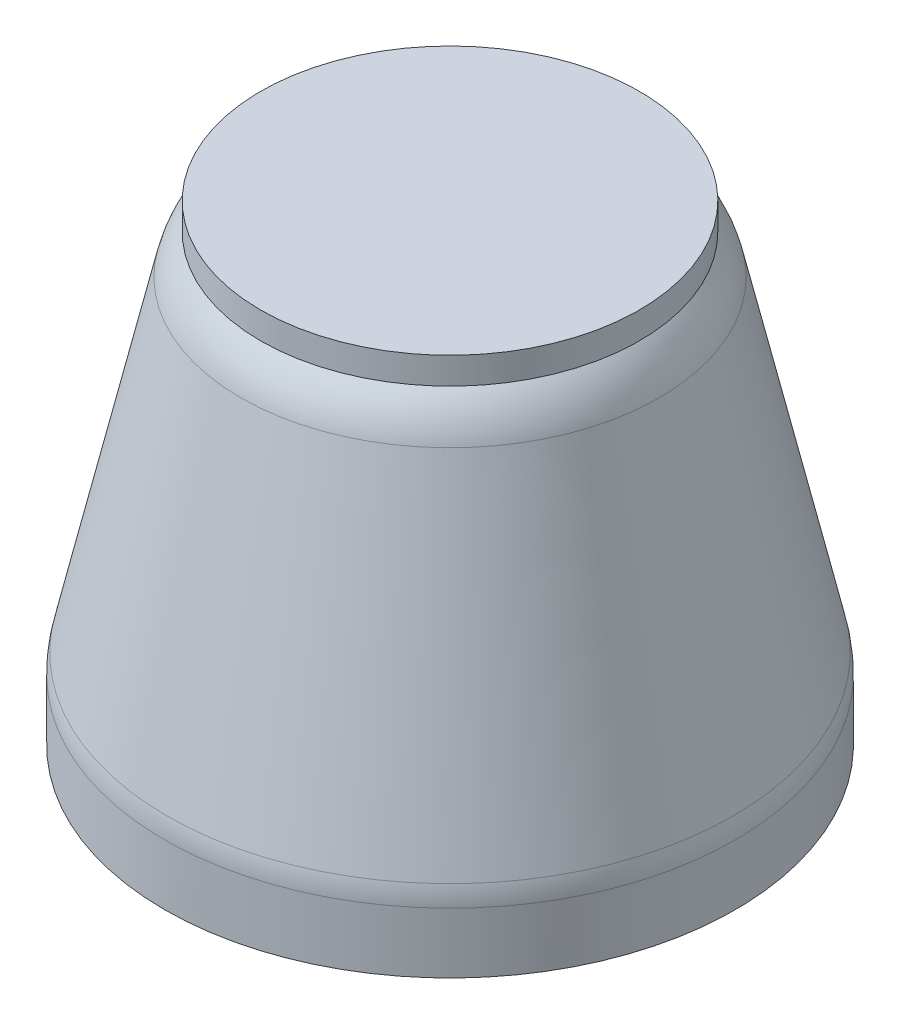
ISO-10303-21;
HEADER;
FILE_DESCRIPTION(('STEP AP214'),'2;1');
FILE_NAME('part.step','',(''),(''),'','','');
FILE_SCHEMA(('AUTOMOTIVE_DESIGN { 1 0 10303 214 1 1 1 1 }'));
ENDSEC;
DATA;
#1=APPLICATION_CONTEXT('core data for automotive mechanical design processes');
#2=APPLICATION_PROTOCOL_DEFINITION('international standard','automotive_design',2000,#1);
#3=PRODUCT_CONTEXT('',#1,'mechanical');
#4=PRODUCT('Part','Part','',(#3));
#5=PRODUCT_RELATED_PRODUCT_CATEGORY('part','',(#4));
#6=PRODUCT_DEFINITION_FORMATION('','',#4);
#7=PRODUCT_DEFINITION_CONTEXT('part definition',#1,'design');
#8=PRODUCT_DEFINITION('design','',#6,#7);
#9=PRODUCT_DEFINITION_SHAPE('','',#8);
#10=(LENGTH_UNIT() NAMED_UNIT(*) SI_UNIT(.MILLI.,.METRE.));
#11=(NAMED_UNIT(*) PLANE_ANGLE_UNIT() SI_UNIT($,.RADIAN.));
#12=(NAMED_UNIT(*) SI_UNIT($,.STERADIAN.) SOLID_ANGLE_UNIT());
#13=UNCERTAINTY_MEASURE_WITH_UNIT(LENGTH_MEASURE(1.E-05),#10,'distance_accuracy_value','');
#14=(GEOMETRIC_REPRESENTATION_CONTEXT(3) GLOBAL_UNCERTAINTY_ASSIGNED_CONTEXT((#13)) GLOBAL_UNIT_ASSIGNED_CONTEXT((#10,
#11,#12)) REPRESENTATION_CONTEXT('',''));
#15=CARTESIAN_POINT('',(0.,0.,0.));
#16=DIRECTION('',(0.,0.,1.));
#17=DIRECTION('',(1.,0.,0.));
#18=AXIS2_PLACEMENT_3D('',#15,#16,#17);
#19=CARTESIAN_POINT('',(0.,15.8,0.));
#20=DIRECTION('',(0.,-1.,0.));
#21=DIRECTION('',(0.,0.,-1.));
#22=AXIS2_PLACEMENT_3D('',#19,#20,#21);
#23=CYLINDRICAL_SURFACE('',#22,64.);
#24=CARTESIAN_POINT('',(0.,13.5663089692838,0.));
#25=DIRECTION('',(0.,-1.,0.));
#26=DIRECTION('',(0.,0.,-1.));
#27=AXIS2_PLACEMENT_3D('',#24,#25,#26);
#28=CIRCLE('',#27,64.);
#29=CARTESIAN_POINT('',(0.,13.5663089692838,-64.));
#30=VERTEX_POINT('',#29);
#31=EDGE_CURVE('E13',#30,#30,#28,.T.);
#32=ORIENTED_EDGE('',*,*,#31,.T.);
#33=EDGE_LOOP('',(#32));
#34=FACE_BOUND('',#33,.T.);
#35=CARTESIAN_POINT('',(0.,0.,0.));
#36=DIRECTION('',(0.,1.,0.));
#37=DIRECTION('',(0.,0.,1.));
#38=AXIS2_PLACEMENT_3D('',#35,#36,#37);
#39=CIRCLE('',#38,64.);
#40=CARTESIAN_POINT('',(0.,0.,64.));
#41=VERTEX_POINT('',#40);
#42=EDGE_CURVE('E61',#41,#41,#39,.T.);
#43=ORIENTED_EDGE('',*,*,#42,.T.);
#44=EDGE_LOOP('',(#43));
#45=FACE_BOUND('',#44,.T.);
#46=ADVANCED_FACE('F46',(#34,#45),#23,.T.);
#47=CARTESIAN_POINT('',(0.,0.,0.));
#48=DIRECTION('',(0.,1.,0.));
#49=DIRECTION('',(0.,0.,1.));
#50=AXIS2_PLACEMENT_3D('',#47,#48,#49);
#51=PLANE('',#50);
#52=CARTESIAN_POINT('',(0.,0.,0.));
#53=DIRECTION('',(0.,-1.,0.));
#54=DIRECTION('',(0.,0.,-1.));
#55=AXIS2_PLACEMENT_3D('',#52,#53,#54);
#56=CIRCLE('',#55,50.);
#57=CARTESIAN_POINT('',(0.,0.,-50.));
#58=VERTEX_POINT('',#57);
#59=EDGE_CURVE('E75',#58,#58,#56,.T.);
#60=ORIENTED_EDGE('',*,*,#59,.F.);
#61=EDGE_LOOP('',(#60));
#62=FACE_BOUND('',#61,.T.);
#63=ORIENTED_EDGE('',*,*,#42,.F.);
#64=EDGE_LOOP('',(#63));
#65=FACE_BOUND('',#64,.T.);
#66=ADVANCED_FACE('F81',(#62,#65),#51,.F.);
#67=CARTESIAN_POINT('',(0.,99.8,0.));
#68=DIRECTION('',(0.,-1.,0.));
#69=DIRECTION('',(0.,0.,-1.));
#70=AXIS2_PLACEMENT_3D('',#67,#68,#69);
#71=CONICAL_SURFACE('',#70,45.,0.222447265425942);
#72=CARTESIAN_POINT('',(0.,91.0034813089583,0.));
#73=DIRECTION('',(0.,-1.,0.));
#74=DIRECTION('',(0.,0.,-1.));
#75=AXIS2_PLACEMENT_3D('',#72,#73,#74);
#76=CIRCLE('',#75,46.9896887515452);
#77=CARTESIAN_POINT('',(0.,91.0034813089583,-46.9896887515452));
#78=VERTEX_POINT('',#77);
#79=EDGE_CURVE('E53',#78,#78,#76,.T.);
#80=ORIENTED_EDGE('',*,*,#79,.T.);
#81=EDGE_LOOP('',(#80));
#82=FACE_BOUND('',#81,.T.);
#83=CARTESIAN_POINT('',(0.,17.9786539149611,0.));
#84=DIRECTION('',(0.,-1.,0.));
#85=DIRECTION('',(0.,0.,-1.));
#86=AXIS2_PLACEMENT_3D('',#83,#84,#85);
#87=CIRCLE('',#86,63.5072092335207);
#88=CARTESIAN_POINT('',(0.,17.9786539149611,-63.5072092335207));
#89=VERTEX_POINT('',#88);
#90=EDGE_CURVE('E57',#89,#89,#87,.F.);
#91=ORIENTED_EDGE('',*,*,#90,.T.);
#92=EDGE_LOOP('',(#91));
#93=FACE_BOUND('',#92,.T.);
#94=ADVANCED_FACE('F84',(#82,#93),#71,.T.);
#95=CARTESIAN_POINT('',(0.,105.8,0.));
#96=DIRECTION('',(0.,-1.,0.));
#97=DIRECTION('',(0.,0.,-1.));
#98=AXIS2_PLACEMENT_3D('',#95,#96,#97);
#99=CYLINDRICAL_SURFACE('',#98,42.5);
#100=CARTESIAN_POINT('',(0.,105.8,0.));
#101=DIRECTION('',(0.,1.,0.));
#102=DIRECTION('',(0.,0.,1.));
#103=AXIS2_PLACEMENT_3D('',#100,#101,#102);
#104=CIRCLE('',#103,42.5);
#105=CARTESIAN_POINT('',(0.,105.8,42.5));
#106=VERTEX_POINT('',#105);
#107=EDGE_CURVE('E66',#106,#106,#104,.T.);
#108=ORIENTED_EDGE('',*,*,#107,.F.);
#109=EDGE_LOOP('',(#108));
#110=FACE_BOUND('',#109,.T.);
#111=CARTESIAN_POINT('',(0.,99.8,0.));
#112=DIRECTION('',(0.,1.,0.));
#113=DIRECTION('',(0.,0.,1.));
#114=AXIS2_PLACEMENT_3D('',#111,#112,#113);
#115=CIRCLE('',#114,42.5);
#116=CARTESIAN_POINT('',(0.,99.8,42.5));
#117=VERTEX_POINT('',#116);
#118=EDGE_CURVE('E67',#117,#117,#115,.T.);
#119=ORIENTED_EDGE('',*,*,#118,.T.);
#120=EDGE_LOOP('',(#119));
#121=FACE_BOUND('',#120,.T.);
#122=ADVANCED_FACE('F102',(#110,#121),#99,.T.);
#123=CARTESIAN_POINT('',(0.,105.8,0.));
#124=DIRECTION('',(0.,1.,0.));
#125=DIRECTION('',(0.,0.,1.));
#126=AXIS2_PLACEMENT_3D('',#123,#124,#125);
#127=PLANE('',#126);
#128=ORIENTED_EDGE('',*,*,#107,.T.);
#129=EDGE_LOOP('',(#128));
#130=FACE_BOUND('',#129,.T.);
#131=ADVANCED_FACE('F95',(#130),#127,.T.);
#132=CARTESIAN_POINT('',(0.,86.591136363281,0.));
#133=DIRECTION('',(0.,1.,0.));
#134=DIRECTION('',(0.,0.,1.));
#135=AXIS2_PLACEMENT_3D('',#132,#133,#134);
#136=TOROIDAL_SURFACE('',#135,27.4824795180244,20.);
#137=ORIENTED_EDGE('',*,*,#79,.F.);
#138=EDGE_LOOP('',(#137));
#139=FACE_BOUND('',#138,.T.);
#140=ORIENTED_EDGE('',*,*,#118,.F.);
#141=EDGE_LOOP('',(#140));
#142=FACE_BOUND('',#141,.T.);
#143=ADVANCED_FACE('F93',(#139,#142),#136,.T.);
#144=CARTESIAN_POINT('',(0.,13.5663089692838,0.));
#145=DIRECTION('',(0.,-1.,0.));
#146=DIRECTION('',(0.,0.,-1.));
#147=AXIS2_PLACEMENT_3D('',#144,#145,#146);
#148=TOROIDAL_SURFACE('',#147,44.,20.);
#149=ORIENTED_EDGE('',*,*,#31,.F.);
#150=EDGE_LOOP('',(#149));
#151=FACE_BOUND('',#150,.T.);
#152=ORIENTED_EDGE('',*,*,#90,.F.);
#153=EDGE_LOOP('',(#152));
#154=FACE_BOUND('',#153,.T.);
#155=ADVANCED_FACE('F48',(#151,#154),#148,.T.);
#156=CARTESIAN_POINT('',(0.,0.,0.));
#157=DIRECTION('',(0.,-1.,0.));
#158=DIRECTION('',(0.,0.,-1.));
#159=AXIS2_PLACEMENT_3D('',#156,#157,#158);
#160=CONICAL_SURFACE('',#159,50.,0.349065850398867);
#161=CARTESIAN_POINT('',(0.,6.,0.));
#162=DIRECTION('',(0.,-1.,0.));
#163=DIRECTION('',(0.,0.,-1.));
#164=AXIS2_PLACEMENT_3D('',#161,#162,#163);
#165=CIRCLE('',#164,47.8161785944028);
#166=CARTESIAN_POINT('',(0.,6.,-47.8161785944028));
#167=VERTEX_POINT('',#166);
#168=EDGE_CURVE('E70',#167,#167,#165,.T.);
#169=ORIENTED_EDGE('',*,*,#168,.F.);
#170=EDGE_LOOP('',(#169));
#171=FACE_BOUND('',#170,.T.);
#172=ORIENTED_EDGE('',*,*,#59,.T.);
#173=EDGE_LOOP('',(#172));
#174=FACE_BOUND('',#173,.T.);
#175=ADVANCED_FACE('F79',(#171,#174),#160,.F.);
#176=CARTESIAN_POINT('',(0.,6.,0.));
#177=DIRECTION('',(0.,-1.,0.));
#178=DIRECTION('',(0.,0.,-1.));
#179=AXIS2_PLACEMENT_3D('',#176,#177,#178);
#180=PLANE('',#179);
#181=ORIENTED_EDGE('',*,*,#168,.T.);
#182=EDGE_LOOP('',(#181));
#183=FACE_BOUND('',#182,.T.);
#184=ADVANCED_FACE('F118',(#183),#180,.T.);
#185=CLOSED_SHELL('',(#46,#66,#94,#122,#131,#143,#155,#175,#184));
#186=MANIFOLD_SOLID_BREP('B2',#185);
#187=ADVANCED_BREP_SHAPE_REPRESENTATION('',(#18,#186),#14);
#188=SHAPE_DEFINITION_REPRESENTATION(#9,#187);
ENDSEC;
END-ISO-10303-21;
